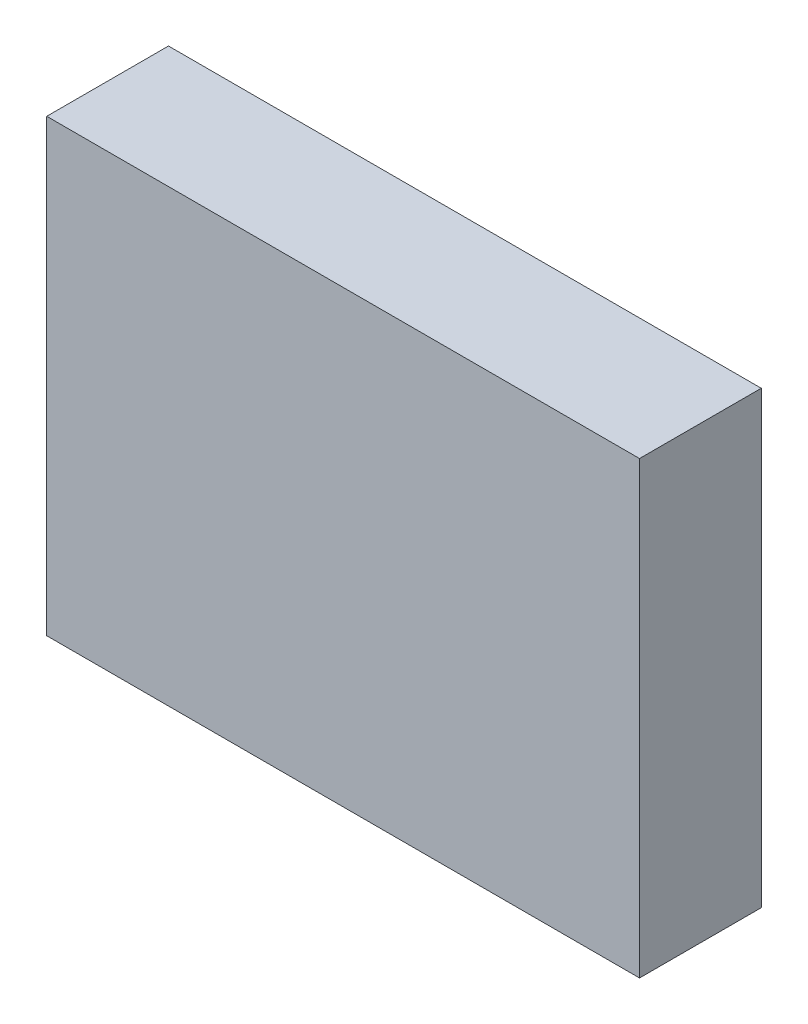
ISO-10303-21;
HEADER;
FILE_DESCRIPTION(('STEP AP214'),'2;1');
FILE_NAME('part.step','',(''),(''),'','','');
FILE_SCHEMA(('AUTOMOTIVE_DESIGN { 1 0 10303 214 1 1 1 1 }'));
ENDSEC;
DATA;
#1=APPLICATION_CONTEXT('core data for automotive mechanical design processes');
#2=APPLICATION_PROTOCOL_DEFINITION('international standard','automotive_design',2000,#1);
#3=PRODUCT_CONTEXT('',#1,'mechanical');
#4=PRODUCT('Part','Part','',(#3));
#5=PRODUCT_RELATED_PRODUCT_CATEGORY('part','',(#4));
#6=PRODUCT_DEFINITION_FORMATION('','',#4);
#7=PRODUCT_DEFINITION_CONTEXT('part definition',#1,'design');
#8=PRODUCT_DEFINITION('design','',#6,#7);
#9=PRODUCT_DEFINITION_SHAPE('','',#8);
#10=(LENGTH_UNIT() NAMED_UNIT(*) SI_UNIT(.MILLI.,.METRE.));
#11=(NAMED_UNIT(*) PLANE_ANGLE_UNIT() SI_UNIT($,.RADIAN.));
#12=(NAMED_UNIT(*) SI_UNIT($,.STERADIAN.) SOLID_ANGLE_UNIT());
#13=UNCERTAINTY_MEASURE_WITH_UNIT(LENGTH_MEASURE(1.E-05),#10,'distance_accuracy_value','');
#14=(GEOMETRIC_REPRESENTATION_CONTEXT(3) GLOBAL_UNCERTAINTY_ASSIGNED_CONTEXT((#13)) GLOBAL_UNIT_ASSIGNED_CONTEXT((#10,
#11,#12)) REPRESENTATION_CONTEXT('',''));
#15=CARTESIAN_POINT('',(0.,0.,0.));
#16=DIRECTION('',(0.,0.,1.));
#17=DIRECTION('',(1.,0.,0.));
#18=AXIS2_PLACEMENT_3D('',#15,#16,#17);
#19=CARTESIAN_POINT('',(0.,0.,4.6));
#20=DIRECTION('',(1.,0.,0.));
#21=DIRECTION('',(0.,0.,-1.));
#22=AXIS2_PLACEMENT_3D('',#19,#20,#21);
#23=PLANE('',#22);
#24=DIRECTION('',(0.,-1.,0.));
#25=VECTOR('',#24,1.);
#26=CARTESIAN_POINT('',(0.,0.,0.));
#27=LINE('',#26,#25);
#28=CARTESIAN_POINT('',(0.,17.,0.));
#29=VERTEX_POINT('',#28);
#30=CARTESIAN_POINT('',(0.,0.,0.));
#31=VERTEX_POINT('',#30);
#32=EDGE_CURVE('E96',#29,#31,#27,.T.);
#33=ORIENTED_EDGE('',*,*,#32,.T.);
#34=DIRECTION('',(0.,0.,-1.));
#35=VECTOR('',#34,1.);
#36=CARTESIAN_POINT('',(0.,0.,4.6));
#37=LINE('',#36,#35);
#38=CARTESIAN_POINT('',(0.,0.,4.6));
#39=VERTEX_POINT('',#38);
#40=EDGE_CURVE('E11',#39,#31,#37,.T.);
#41=ORIENTED_EDGE('',*,*,#40,.F.);
#42=DIRECTION('',(0.,-1.,0.));
#43=VECTOR('',#42,1.);
#44=CARTESIAN_POINT('',(0.,0.,4.6));
#45=LINE('',#44,#43);
#46=CARTESIAN_POINT('',(0.,17.,4.6));
#47=VERTEX_POINT('',#46);
#48=EDGE_CURVE('E84',#47,#39,#45,.T.);
#49=ORIENTED_EDGE('',*,*,#48,.F.);
#50=DIRECTION('',(0.,0.,-1.));
#51=VECTOR('',#50,1.);
#52=CARTESIAN_POINT('',(0.,17.,4.6));
#53=LINE('',#52,#51);
#54=EDGE_CURVE('E92',#47,#29,#53,.T.);
#55=ORIENTED_EDGE('',*,*,#54,.T.);
#56=EDGE_LOOP('',(#33,#41,#49,#55));
#57=FACE_BOUND('',#56,.T.);
#58=ADVANCED_FACE('F33',(#57),#23,.F.);
#59=CARTESIAN_POINT('',(0.,0.,4.6));
#60=DIRECTION('',(0.,1.,0.));
#61=DIRECTION('',(0.,0.,1.));
#62=AXIS2_PLACEMENT_3D('',#59,#60,#61);
#63=PLANE('',#62);
#64=DIRECTION('',(1.,0.,0.));
#65=VECTOR('',#64,1.);
#66=CARTESIAN_POINT('',(0.,0.,0.));
#67=LINE('',#66,#65);
#68=CARTESIAN_POINT('',(22.4,0.,0.));
#69=VERTEX_POINT('',#68);
#70=EDGE_CURVE('E88',#31,#69,#67,.T.);
#71=ORIENTED_EDGE('',*,*,#70,.T.);
#72=DIRECTION('',(0.,0.,-1.));
#73=VECTOR('',#72,1.);
#74=CARTESIAN_POINT('',(22.4,0.,4.6));
#75=LINE('',#74,#73);
#76=CARTESIAN_POINT('',(22.4,0.,4.6));
#77=VERTEX_POINT('',#76);
#78=EDGE_CURVE('E41',#77,#69,#75,.T.);
#79=ORIENTED_EDGE('',*,*,#78,.F.);
#80=DIRECTION('',(1.,0.,0.));
#81=VECTOR('',#80,1.);
#82=CARTESIAN_POINT('',(0.,0.,4.6));
#83=LINE('',#82,#81);
#84=EDGE_CURVE('E79',#39,#77,#83,.T.);
#85=ORIENTED_EDGE('',*,*,#84,.F.);
#86=ORIENTED_EDGE('',*,*,#40,.T.);
#87=EDGE_LOOP('',(#71,#79,#85,#86));
#88=FACE_BOUND('',#87,.T.);
#89=ADVANCED_FACE('F87',(#88),#63,.F.);
#90=CARTESIAN_POINT('',(22.4,0.,4.6));
#91=DIRECTION('',(-1.,0.,0.));
#92=DIRECTION('',(0.,0.,1.));
#93=AXIS2_PLACEMENT_3D('',#90,#91,#92);
#94=PLANE('',#93);
#95=DIRECTION('',(0.,1.,0.));
#96=VECTOR('',#95,1.);
#97=CARTESIAN_POINT('',(22.4,0.,0.));
#98=LINE('',#97,#96);
#99=CARTESIAN_POINT('',(22.4,17.,0.));
#100=VERTEX_POINT('',#99);
#101=EDGE_CURVE('E66',#69,#100,#98,.T.);
#102=ORIENTED_EDGE('',*,*,#101,.T.);
#103=DIRECTION('',(0.,0.,-1.));
#104=VECTOR('',#103,1.);
#105=CARTESIAN_POINT('',(22.4,17.,4.6));
#106=LINE('',#105,#104);
#107=CARTESIAN_POINT('',(22.4,17.,4.6));
#108=VERTEX_POINT('',#107);
#109=EDGE_CURVE('E89',#108,#100,#106,.T.);
#110=ORIENTED_EDGE('',*,*,#109,.F.);
#111=DIRECTION('',(0.,1.,0.));
#112=VECTOR('',#111,1.);
#113=CARTESIAN_POINT('',(22.4,0.,4.6));
#114=LINE('',#113,#112);
#115=EDGE_CURVE('E82',#77,#108,#114,.T.);
#116=ORIENTED_EDGE('',*,*,#115,.F.);
#117=ORIENTED_EDGE('',*,*,#78,.T.);
#118=EDGE_LOOP('',(#102,#110,#116,#117));
#119=FACE_BOUND('',#118,.T.);
#120=ADVANCED_FACE('F90',(#119),#94,.F.);
#121=CARTESIAN_POINT('',(0.,17.,4.6));
#122=DIRECTION('',(0.,-1.,0.));
#123=DIRECTION('',(0.,0.,-1.));
#124=AXIS2_PLACEMENT_3D('',#121,#122,#123);
#125=PLANE('',#124);
#126=DIRECTION('',(-1.,0.,0.));
#127=VECTOR('',#126,1.);
#128=CARTESIAN_POINT('',(0.,17.,0.));
#129=LINE('',#128,#127);
#130=EDGE_CURVE('E72',#100,#29,#129,.T.);
#131=ORIENTED_EDGE('',*,*,#130,.T.);
#132=ORIENTED_EDGE('',*,*,#54,.F.);
#133=DIRECTION('',(-1.,0.,0.));
#134=VECTOR('',#133,1.);
#135=CARTESIAN_POINT('',(0.,17.,4.6));
#136=LINE('',#135,#134);
#137=EDGE_CURVE('E49',#108,#47,#136,.T.);
#138=ORIENTED_EDGE('',*,*,#137,.F.);
#139=ORIENTED_EDGE('',*,*,#109,.T.);
#140=EDGE_LOOP('',(#131,#132,#138,#139));
#141=FACE_BOUND('',#140,.T.);
#142=ADVANCED_FACE('F103',(#141),#125,.F.);
#143=CARTESIAN_POINT('',(0.,0.,4.6));
#144=DIRECTION('',(0.,0.,-1.));
#145=DIRECTION('',(-1.,0.,0.));
#146=AXIS2_PLACEMENT_3D('',#143,#144,#145);
#147=PLANE('',#146);
#148=ORIENTED_EDGE('',*,*,#48,.T.);
#149=ORIENTED_EDGE('',*,*,#84,.T.);
#150=ORIENTED_EDGE('',*,*,#115,.T.);
#151=ORIENTED_EDGE('',*,*,#137,.T.);
#152=EDGE_LOOP('',(#148,#149,#150,#151));
#153=FACE_BOUND('',#152,.T.);
#154=ADVANCED_FACE('F80',(#153),#147,.F.);
#155=CARTESIAN_POINT('',(0.,0.,0.));
#156=DIRECTION('',(0.,0.,-1.));
#157=DIRECTION('',(-1.,0.,0.));
#158=AXIS2_PLACEMENT_3D('',#155,#156,#157);
#159=PLANE('',#158);
#160=ORIENTED_EDGE('',*,*,#32,.F.);
#161=ORIENTED_EDGE('',*,*,#130,.F.);
#162=ORIENTED_EDGE('',*,*,#101,.F.);
#163=ORIENTED_EDGE('',*,*,#70,.F.);
#164=EDGE_LOOP('',(#160,#161,#162,#163));
#165=FACE_BOUND('',#164,.T.);
#166=ADVANCED_FACE('F106',(#165),#159,.T.);
#167=CLOSED_SHELL('',(#58,#89,#120,#142,#154,#166));
#168=MANIFOLD_SOLID_BREP('B2',#167);
#169=ADVANCED_BREP_SHAPE_REPRESENTATION('',(#18,#168),#14);
#170=SHAPE_DEFINITION_REPRESENTATION(#9,#169);
ENDSEC;
END-ISO-10303-21;
